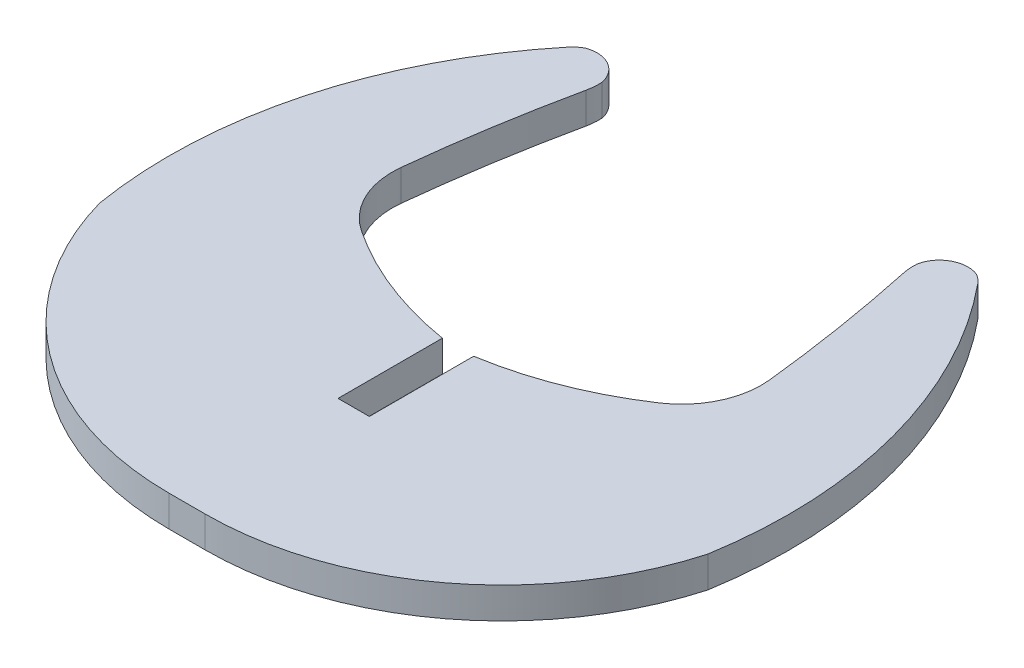
ISO-10303-21;
HEADER;
FILE_DESCRIPTION(('STEP AP214'),'2;1');
FILE_NAME('part.step','',(''),(''),'','','');
FILE_SCHEMA(('AUTOMOTIVE_DESIGN { 1 0 10303 214 1 1 1 1 }'));
ENDSEC;
DATA;
#1=APPLICATION_CONTEXT('core data for automotive mechanical design processes');
#2=APPLICATION_PROTOCOL_DEFINITION('international standard','automotive_design',2000,#1);
#3=PRODUCT_CONTEXT('',#1,'mechanical');
#4=PRODUCT('Part','Part','',(#3));
#5=PRODUCT_RELATED_PRODUCT_CATEGORY('part','',(#4));
#6=PRODUCT_DEFINITION_FORMATION('','',#4);
#7=PRODUCT_DEFINITION_CONTEXT('part definition',#1,'design');
#8=PRODUCT_DEFINITION('design','',#6,#7);
#9=PRODUCT_DEFINITION_SHAPE('','',#8);
#10=(LENGTH_UNIT() NAMED_UNIT(*) SI_UNIT(.MILLI.,.METRE.));
#11=(NAMED_UNIT(*) PLANE_ANGLE_UNIT() SI_UNIT($,.RADIAN.));
#12=(NAMED_UNIT(*) SI_UNIT($,.STERADIAN.) SOLID_ANGLE_UNIT());
#13=UNCERTAINTY_MEASURE_WITH_UNIT(LENGTH_MEASURE(1.E-05),#10,'distance_accuracy_value','');
#14=(GEOMETRIC_REPRESENTATION_CONTEXT(3) GLOBAL_UNCERTAINTY_ASSIGNED_CONTEXT((#13)) GLOBAL_UNIT_ASSIGNED_CONTEXT((#10,
#11,#12)) REPRESENTATION_CONTEXT('',''));
#15=CARTESIAN_POINT('',(0.,0.,0.));
#16=DIRECTION('',(0.,0.,1.));
#17=DIRECTION('',(1.,0.,0.));
#18=AXIS2_PLACEMENT_3D('',#15,#16,#17);
#19=CARTESIAN_POINT('',(197.378953118719,1.45,-339.570008902451));
#20=DIRECTION('',(0.,-1.,0.));
#21=DIRECTION('',(0.,0.,-1.));
#22=AXIS2_PLACEMENT_3D('',#19,#20,#21);
#23=CYLINDRICAL_SURFACE('',#22,21.547899274008);
#24=CARTESIAN_POINT('',(197.378953118719,0.,-339.570008902451));
#25=DIRECTION('',(0.,1.,0.));
#26=DIRECTION('',(0.,0.,1.));
#27=AXIS2_PLACEMENT_3D('',#24,#25,#26);
#28=CIRCLE('',#27,21.547899274008);
#29=CARTESIAN_POINT('',(218.640395151837,0.,-336.068145713355));
#30=VERTEX_POINT('',#29);
#31=CARTESIAN_POINT('',(214.015718080586,0.,-353.264168779069));
#32=VERTEX_POINT('',#31);
#33=EDGE_CURVE('E205',#30,#32,#28,.T.);
#34=ORIENTED_EDGE('',*,*,#33,.T.);
#35=DIRECTION('',(0.,-1.,0.));
#36=VECTOR('',#35,1.);
#37=CARTESIAN_POINT('',(214.015718080586,1.45,-353.264168779069));
#38=LINE('',#37,#36);
#39=CARTESIAN_POINT('',(214.015718080586,1.45,-353.264168779069));
#40=VERTEX_POINT('',#39);
#41=EDGE_CURVE('E11',#40,#32,#38,.T.);
#42=ORIENTED_EDGE('',*,*,#41,.F.);
#43=CARTESIAN_POINT('',(197.378953118719,1.45,-339.570008902451));
#44=DIRECTION('',(0.,1.,0.));
#45=DIRECTION('',(0.,0.,1.));
#46=AXIS2_PLACEMENT_3D('',#43,#44,#45);
#47=CIRCLE('',#46,21.547899274008);
#48=CARTESIAN_POINT('',(218.640395151837,1.45,-336.068145713355));
#49=VERTEX_POINT('',#48);
#50=EDGE_CURVE('E253',#49,#40,#47,.T.);
#51=ORIENTED_EDGE('',*,*,#50,.F.);
#52=DIRECTION('',(0.,-1.,0.));
#53=VECTOR('',#52,1.);
#54=CARTESIAN_POINT('',(218.640395151837,1.45,-336.068145713355));
#55=LINE('',#54,#53);
#56=EDGE_CURVE('E201',#49,#30,#55,.T.);
#57=ORIENTED_EDGE('',*,*,#56,.T.);
#58=EDGE_LOOP('',(#34,#42,#51,#57));
#59=FACE_BOUND('',#58,.T.);
#60=ADVANCED_FACE('F37',(#59),#23,.T.);
#61=CARTESIAN_POINT('',(212.885365432864,1.45,-352.333745075984));
#62=DIRECTION('',(0.,-1.,0.));
#63=DIRECTION('',(0.,0.,-1.));
#64=AXIS2_PLACEMENT_3D('',#61,#62,#63);
#65=CYLINDRICAL_SURFACE('',#64,1.46403052409316);
#66=CARTESIAN_POINT('',(212.885365432864,0.,-352.333745075984));
#67=DIRECTION('',(0.,1.,0.));
#68=DIRECTION('',(0.,0.,1.));
#69=AXIS2_PLACEMENT_3D('',#66,#67,#68);
#70=CIRCLE('',#69,1.46403052409316);
#71=CARTESIAN_POINT('',(213.583617021441,0.,-353.620535693966));
#72=VERTEX_POINT('',#71);
#73=EDGE_CURVE('E208',#32,#72,#70,.T.);
#74=ORIENTED_EDGE('',*,*,#73,.T.);
#75=DIRECTION('',(0.,-1.,0.));
#76=VECTOR('',#75,1.);
#77=CARTESIAN_POINT('',(213.583617021441,1.45,-353.620535693966));
#78=LINE('',#77,#76);
#79=CARTESIAN_POINT('',(213.583617021441,1.45,-353.620535693966));
#80=VERTEX_POINT('',#79);
#81=EDGE_CURVE('E45',#80,#72,#78,.T.);
#82=ORIENTED_EDGE('',*,*,#81,.F.);
#83=CARTESIAN_POINT('',(212.885365432864,1.45,-352.333745075984));
#84=DIRECTION('',(0.,1.,0.));
#85=DIRECTION('',(0.,0.,1.));
#86=AXIS2_PLACEMENT_3D('',#83,#84,#85);
#87=CIRCLE('',#86,1.46403052409316);
#88=EDGE_CURVE('E132',#40,#80,#87,.T.);
#89=ORIENTED_EDGE('',*,*,#88,.F.);
#90=ORIENTED_EDGE('',*,*,#41,.T.);
#91=EDGE_LOOP('',(#74,#82,#89,#90));
#92=FACE_BOUND('',#91,.T.);
#93=ADVANCED_FACE('F365',(#92),#65,.T.);
#94=CARTESIAN_POINT('',(213.114991460386,1.45,-352.377037473618));
#95=DIRECTION('',(0.,-1.,0.));
#96=DIRECTION('',(0.,0.,-1.));
#97=AXIS2_PLACEMENT_3D('',#94,#95,#96);
#98=CYLINDRICAL_SURFACE('',#97,1.32887085169409);
#99=CARTESIAN_POINT('',(213.114991460386,0.,-352.377037473618));
#100=DIRECTION('',(0.,1.,0.));
#101=DIRECTION('',(0.,0.,1.));
#102=AXIS2_PLACEMENT_3D('',#99,#100,#101);
#103=CIRCLE('',#102,1.32887085169409);
#104=CARTESIAN_POINT('',(211.813219702739,0.,-352.644035659891));
#105=VERTEX_POINT('',#104);
#106=EDGE_CURVE('E210',#72,#105,#103,.T.);
#107=ORIENTED_EDGE('',*,*,#106,.T.);
#108=DIRECTION('',(0.,-1.,0.));
#109=VECTOR('',#108,1.);
#110=CARTESIAN_POINT('',(211.813219702739,1.45,-352.644035659891));
#111=LINE('',#110,#109);
#112=CARTESIAN_POINT('',(211.813219702739,1.45,-352.644035659891));
#113=VERTEX_POINT('',#112);
#114=EDGE_CURVE('E286',#113,#105,#111,.T.);
#115=ORIENTED_EDGE('',*,*,#114,.F.);
#116=CARTESIAN_POINT('',(213.114991460386,1.45,-352.377037473618));
#117=DIRECTION('',(0.,1.,0.));
#118=DIRECTION('',(0.,0.,1.));
#119=AXIS2_PLACEMENT_3D('',#116,#117,#118);
#120=CIRCLE('',#119,1.32887085169409);
#121=EDGE_CURVE('E294',#80,#113,#120,.T.);
#122=ORIENTED_EDGE('',*,*,#121,.F.);
#123=ORIENTED_EDGE('',*,*,#81,.T.);
#124=EDGE_LOOP('',(#107,#115,#122,#123));
#125=FACE_BOUND('',#124,.T.);
#126=ADVANCED_FACE('F292',(#125),#98,.T.);
#127=CARTESIAN_POINT('',(214.410192294144,1.45,-352.48032588995));
#128=DIRECTION('',(0.,-1.,0.));
#129=DIRECTION('',(0.,0.,-1.));
#130=AXIS2_PLACEMENT_3D('',#127,#128,#129);
#131=CYLINDRICAL_SURFACE('',#130,2.60212750058202);
#132=CARTESIAN_POINT('',(214.410192294144,0.,-352.48032588995));
#133=DIRECTION('',(0.,1.,0.));
#134=DIRECTION('',(0.,0.,1.));
#135=AXIS2_PLACEMENT_3D('',#132,#133,#134);
#136=CIRCLE('',#135,2.60212750058202);
#137=CARTESIAN_POINT('',(211.865695854604,0.,-351.93571098155));
#138=VERTEX_POINT('',#137);
#139=EDGE_CURVE('E212',#105,#138,#136,.T.);
#140=ORIENTED_EDGE('',*,*,#139,.T.);
#141=DIRECTION('',(0.,-1.,0.));
#142=VECTOR('',#141,1.);
#143=CARTESIAN_POINT('',(211.865695854604,1.45,-351.93571098155));
#144=LINE('',#143,#142);
#145=CARTESIAN_POINT('',(211.865695854604,1.45,-351.93571098155));
#146=VERTEX_POINT('',#145);
#147=EDGE_CURVE('E284',#146,#138,#144,.T.);
#148=ORIENTED_EDGE('',*,*,#147,.F.);
#149=CARTESIAN_POINT('',(214.410192294144,1.45,-352.48032588995));
#150=DIRECTION('',(0.,1.,0.));
#151=DIRECTION('',(0.,0.,1.));
#152=AXIS2_PLACEMENT_3D('',#149,#150,#151);
#153=CIRCLE('',#152,2.60212750058202);
#154=EDGE_CURVE('E305',#113,#146,#153,.T.);
#155=ORIENTED_EDGE('',*,*,#154,.F.);
#156=ORIENTED_EDGE('',*,*,#114,.T.);
#157=EDGE_LOOP('',(#140,#148,#155,#156));
#158=FACE_BOUND('',#157,.T.);
#159=ADVANCED_FACE('F302',(#158),#131,.T.);
#160=CARTESIAN_POINT('',(140.904641555908,1.45,-336.747453381316));
#161=DIRECTION('',(0.,-1.,0.));
#162=DIRECTION('',(0.,0.,-1.));
#163=AXIS2_PLACEMENT_3D('',#160,#161,#162);
#164=CYLINDRICAL_SURFACE('',#163,72.568274032896);
#165=CARTESIAN_POINT('',(140.904641555908,0.,-336.747453381316));
#166=DIRECTION('',(0.,1.,0.));
#167=DIRECTION('',(0.,0.,1.));
#168=AXIS2_PLACEMENT_3D('',#165,#166,#167);
#169=CIRCLE('',#168,72.568274032896);
#170=CARTESIAN_POINT('',(213.055076149438,0.,-344.523646799577));
#171=VERTEX_POINT('',#170);
#172=EDGE_CURVE('E215',#171,#138,#169,.T.);
#173=ORIENTED_EDGE('',*,*,#172,.F.);
#174=DIRECTION('',(0.,-1.,0.));
#175=VECTOR('',#174,1.);
#176=CARTESIAN_POINT('',(213.055076149438,1.45,-344.523646799577));
#177=LINE('',#176,#175);
#178=CARTESIAN_POINT('',(213.055076149438,1.45,-344.523646799577));
#179=VERTEX_POINT('',#178);
#180=EDGE_CURVE('E282',#179,#171,#177,.T.);
#181=ORIENTED_EDGE('',*,*,#180,.F.);
#182=CARTESIAN_POINT('',(140.904641555908,1.45,-336.747453381316));
#183=DIRECTION('',(0.,1.,0.));
#184=DIRECTION('',(0.,0.,1.));
#185=AXIS2_PLACEMENT_3D('',#182,#183,#184);
#186=CIRCLE('',#185,72.568274032896);
#187=EDGE_CURVE('E307',#179,#146,#186,.T.);
#188=ORIENTED_EDGE('',*,*,#187,.T.);
#189=ORIENTED_EDGE('',*,*,#147,.T.);
#190=EDGE_LOOP('',(#173,#181,#188,#189));
#191=FACE_BOUND('',#190,.T.);
#192=ADVANCED_FACE('F376',(#191),#164,.F.);
#193=CARTESIAN_POINT('',(209.3653105977,1.45,-344.125972982407));
#194=DIRECTION('',(0.,-1.,0.));
#195=DIRECTION('',(0.,0.,-1.));
#196=AXIS2_PLACEMENT_3D('',#193,#194,#195);
#197=CYLINDRICAL_SURFACE('',#196,3.71113382831392);
#198=CARTESIAN_POINT('',(209.3653105977,0.,-344.125972982407));
#199=DIRECTION('',(0.,1.,0.));
#200=DIRECTION('',(0.,0.,1.));
#201=AXIS2_PLACEMENT_3D('',#198,#199,#200);
#202=CIRCLE('',#201,3.71113382831392);
#203=CARTESIAN_POINT('',(211.425013911773,0.,-341.038881058014));
#204=VERTEX_POINT('',#203);
#205=EDGE_CURVE('E218',#204,#171,#202,.T.);
#206=ORIENTED_EDGE('',*,*,#205,.F.);
#207=DIRECTION('',(0.,-1.,0.));
#208=VECTOR('',#207,1.);
#209=CARTESIAN_POINT('',(211.425013911773,1.45,-341.038881058014));
#210=LINE('',#209,#208);
#211=CARTESIAN_POINT('',(211.425013911773,1.45,-341.038881058014));
#212=VERTEX_POINT('',#211);
#213=EDGE_CURVE('E280',#212,#204,#210,.T.);
#214=ORIENTED_EDGE('',*,*,#213,.F.);
#215=CARTESIAN_POINT('',(209.3653105977,1.45,-344.125972982407));
#216=DIRECTION('',(0.,1.,0.));
#217=DIRECTION('',(0.,0.,1.));
#218=AXIS2_PLACEMENT_3D('',#215,#216,#217);
#219=CIRCLE('',#218,3.71113382831392);
#220=EDGE_CURVE('E309',#212,#179,#219,.T.);
#221=ORIENTED_EDGE('',*,*,#220,.T.);
#222=ORIENTED_EDGE('',*,*,#180,.T.);
#223=EDGE_LOOP('',(#206,#214,#221,#222));
#224=FACE_BOUND('',#223,.T.);
#225=ADVANCED_FACE('F379',(#224),#197,.F.);
#226=CARTESIAN_POINT('',(202.672696827723,1.45,-354.156888171361));
#227=DIRECTION('',(0.,-1.,0.));
#228=DIRECTION('',(0.,0.,-1.));
#229=AXIS2_PLACEMENT_3D('',#226,#227,#228);
#230=CYLINDRICAL_SURFACE('',#229,15.769754752867);
#231=CARTESIAN_POINT('',(202.672696827723,0.,-354.156888171361));
#232=DIRECTION('',(0.,1.,0.));
#233=DIRECTION('',(0.,0.,1.));
#234=AXIS2_PLACEMENT_3D('',#231,#232,#233);
#235=CIRCLE('',#234,15.769754752867);
#236=CARTESIAN_POINT('',(205.206272308741,0.,-338.591986621799));
#237=VERTEX_POINT('',#236);
#238=EDGE_CURVE('E221',#237,#204,#235,.T.);
#239=ORIENTED_EDGE('',*,*,#238,.F.);
#240=DIRECTION('',(0.,-1.,0.));
#241=VECTOR('',#240,1.);
#242=CARTESIAN_POINT('',(205.206272308741,1.45,-338.591986621799));
#243=LINE('',#242,#241);
#244=CARTESIAN_POINT('',(205.206272308741,1.45,-338.591986621799));
#245=VERTEX_POINT('',#244);
#246=EDGE_CURVE('E278',#245,#237,#243,.T.);
#247=ORIENTED_EDGE('',*,*,#246,.F.);
#248=CARTESIAN_POINT('',(202.672696827723,1.45,-354.156888171361));
#249=DIRECTION('',(0.,1.,0.));
#250=DIRECTION('',(0.,0.,1.));
#251=AXIS2_PLACEMENT_3D('',#248,#249,#250);
#252=CIRCLE('',#251,15.769754752867);
#253=EDGE_CURVE('E316',#245,#212,#252,.T.);
#254=ORIENTED_EDGE('',*,*,#253,.T.);
#255=ORIENTED_EDGE('',*,*,#213,.T.);
#256=EDGE_LOOP('',(#239,#247,#254,#255));
#257=FACE_BOUND('',#256,.T.);
#258=ADVANCED_FACE('F383',(#257),#230,.F.);
#259=CARTESIAN_POINT('',(205.206272308729,1.45,-266.90667072089));
#260=DIRECTION('',(-1.,0.,-1.71330523696953E-13));
#261=DIRECTION('',(-1.71330523696953E-13,0.,1.));
#262=AXIS2_PLACEMENT_3D('',#259,#260,#261);
#263=PLANE('',#262);
#264=DIRECTION('',(1.71330523696953E-13,0.,-1.));
#265=VECTOR('',#264,1.);
#266=CARTESIAN_POINT('',(205.206272308729,0.,-266.90667072089));
#267=LINE('',#266,#265);
#268=CARTESIAN_POINT('',(205.20627230874,0.,-333.73198123279));
#269=VERTEX_POINT('',#268);
#270=EDGE_CURVE('E224',#269,#237,#267,.T.);
#271=ORIENTED_EDGE('',*,*,#270,.F.);
#272=DIRECTION('',(0.,-1.,0.));
#273=VECTOR('',#272,1.);
#274=CARTESIAN_POINT('',(205.20627230874,1.45,-333.73198123279));
#275=LINE('',#274,#273);
#276=CARTESIAN_POINT('',(205.20627230874,1.45,-333.73198123279));
#277=VERTEX_POINT('',#276);
#278=EDGE_CURVE('E276',#277,#269,#275,.T.);
#279=ORIENTED_EDGE('',*,*,#278,.F.);
#280=DIRECTION('',(1.71330523696953E-13,0.,-1.));
#281=VECTOR('',#280,1.);
#282=CARTESIAN_POINT('',(205.206272308729,1.45,-266.90667072089));
#283=LINE('',#282,#281);
#284=EDGE_CURVE('E319',#277,#245,#283,.T.);
#285=ORIENTED_EDGE('',*,*,#284,.T.);
#286=ORIENTED_EDGE('',*,*,#246,.T.);
#287=EDGE_LOOP('',(#271,#279,#285,#286));
#288=FACE_BOUND('',#287,.T.);
#289=ADVANCED_FACE('F387',(#288),#263,.T.);
#290=CARTESIAN_POINT('',(-48.360559474051,1.45,-333.73198123279));
#291=DIRECTION('',(0.,0.,-1.));
#292=DIRECTION('',(-1.,0.,0.));
#293=AXIS2_PLACEMENT_3D('',#290,#291,#292);
#294=PLANE('',#293);
#295=DIRECTION('',(1.,0.,0.));
#296=VECTOR('',#295,1.);
#297=CARTESIAN_POINT('',(-48.360559474051,0.,-333.73198123279));
#298=LINE('',#297,#296);
#299=CARTESIAN_POINT('',(203.74827050989,0.,-333.73198123279));
#300=VERTEX_POINT('',#299);
#301=EDGE_CURVE('E227',#300,#269,#298,.T.);
#302=ORIENTED_EDGE('',*,*,#301,.F.);
#303=DIRECTION('',(0.,-1.,0.));
#304=VECTOR('',#303,1.);
#305=CARTESIAN_POINT('',(203.74827050989,1.45,-333.73198123279));
#306=LINE('',#305,#304);
#307=CARTESIAN_POINT('',(203.74827050989,1.45,-333.73198123279));
#308=VERTEX_POINT('',#307);
#309=EDGE_CURVE('E274',#308,#300,#306,.T.);
#310=ORIENTED_EDGE('',*,*,#309,.F.);
#311=DIRECTION('',(1.,0.,0.));
#312=VECTOR('',#311,1.);
#313=CARTESIAN_POINT('',(-48.360559474051,1.45,-333.73198123279));
#314=LINE('',#313,#312);
#315=EDGE_CURVE('E322',#308,#277,#314,.T.);
#316=ORIENTED_EDGE('',*,*,#315,.T.);
#317=ORIENTED_EDGE('',*,*,#278,.T.);
#318=EDGE_LOOP('',(#302,#310,#316,#317));
#319=FACE_BOUND('',#318,.T.);
#320=ADVANCED_FACE('F391',(#319),#294,.T.);
#321=CARTESIAN_POINT('',(203.748281316028,1.45,-266.90671148879));
#322=DIRECTION('',(-0.999999999999987,0.,1.61707366351748E-07));
#323=DIRECTION('',(1.61707366351748E-07,0.,0.999999999999987));
#324=AXIS2_PLACEMENT_3D('',#321,#322,#323);
#325=PLANE('',#324);
#326=DIRECTION('',(-1.61707366351748E-07,0.,-0.999999999999987));
#327=VECTOR('',#326,1.);
#328=CARTESIAN_POINT('',(203.748281316028,0.,-266.90671148879));
#329=LINE('',#328,#327);
#330=CARTESIAN_POINT('',(203.748269723991,0.,-338.591986840162));
#331=VERTEX_POINT('',#330);
#332=EDGE_CURVE('E230',#300,#331,#329,.T.);
#333=ORIENTED_EDGE('',*,*,#332,.T.);
#334=DIRECTION('',(0.,-1.,0.));
#335=VECTOR('',#334,1.);
#336=CARTESIAN_POINT('',(203.748269723991,1.45,-338.591986840162));
#337=LINE('',#336,#335);
#338=CARTESIAN_POINT('',(203.748269723991,1.45,-338.591986840162));
#339=VERTEX_POINT('',#338);
#340=EDGE_CURVE('E272',#339,#331,#337,.T.);
#341=ORIENTED_EDGE('',*,*,#340,.F.);
#342=DIRECTION('',(-1.61707366351748E-07,0.,-0.999999999999987));
#343=VECTOR('',#342,1.);
#344=CARTESIAN_POINT('',(203.748281316028,1.45,-266.90671148879));
#345=LINE('',#344,#343);
#346=EDGE_CURVE('E325',#308,#339,#345,.T.);
#347=ORIENTED_EDGE('',*,*,#346,.F.);
#348=ORIENTED_EDGE('',*,*,#309,.T.);
#349=EDGE_LOOP('',(#333,#341,#347,#348));
#350=FACE_BOUND('',#349,.T.);
#351=ADVANCED_FACE('F395',(#350),#325,.F.);
#352=CARTESIAN_POINT('',(206.281846596879,1.45,-354.156888163163));
#353=DIRECTION('',(0.,-1.,0.));
#354=DIRECTION('',(0.,0.,-1.));
#355=AXIS2_PLACEMENT_3D('',#352,#353,#354);
#356=CYLINDRICAL_SURFACE('',#355,15.769754752867);
#357=CARTESIAN_POINT('',(206.281846596879,0.,-354.156888163163));
#358=DIRECTION('',(0.,1.,0.));
#359=DIRECTION('',(0.,0.,1.));
#360=AXIS2_PLACEMENT_3D('',#357,#358,#359);
#361=CIRCLE('',#360,15.769754752867);
#362=CARTESIAN_POINT('',(197.529529117413,0.,-341.038881313636));
#363=VERTEX_POINT('',#362);
#364=EDGE_CURVE('E233',#363,#331,#361,.T.);
#365=ORIENTED_EDGE('',*,*,#364,.F.);
#366=DIRECTION('',(0.,-1.,0.));
#367=VECTOR('',#366,1.);
#368=CARTESIAN_POINT('',(197.529529117413,1.45,-341.038881313636));
#369=LINE('',#368,#367);
#370=CARTESIAN_POINT('',(197.529529117413,1.45,-341.038881313636));
#371=VERTEX_POINT('',#370);
#372=EDGE_CURVE('E270',#371,#363,#369,.T.);
#373=ORIENTED_EDGE('',*,*,#372,.F.);
#374=CARTESIAN_POINT('',(206.281846596879,1.45,-354.156888163163));
#375=DIRECTION('',(0.,1.,0.));
#376=DIRECTION('',(0.,0.,1.));
#377=AXIS2_PLACEMENT_3D('',#374,#375,#376);
#378=CIRCLE('',#377,15.769754752867);
#379=EDGE_CURVE('E327',#371,#339,#378,.T.);
#380=ORIENTED_EDGE('',*,*,#379,.T.);
#381=ORIENTED_EDGE('',*,*,#340,.T.);
#382=EDGE_LOOP('',(#365,#373,#380,#381));
#383=FACE_BOUND('',#382,.T.);
#384=ADVANCED_FACE('F399',(#383),#356,.F.);
#385=CARTESIAN_POINT('',(199.589232463917,1.45,-344.125973216391));
#386=DIRECTION('',(0.,-1.,0.));
#387=DIRECTION('',(0.,0.,-1.));
#388=AXIS2_PLACEMENT_3D('',#385,#386,#387);
#389=CYLINDRICAL_SURFACE('',#388,3.71113382831382);
#390=CARTESIAN_POINT('',(199.589232463917,0.,-344.125973216391));
#391=DIRECTION('',(0.,1.,0.));
#392=DIRECTION('',(0.,0.,1.));
#393=AXIS2_PLACEMENT_3D('',#390,#391,#392);
#394=CIRCLE('',#393,3.71113382831382);
#395=CARTESIAN_POINT('',(195.899466211039,0.,-344.523640528065));
#396=VERTEX_POINT('',#395);
#397=EDGE_CURVE('E236',#396,#363,#394,.T.);
#398=ORIENTED_EDGE('',*,*,#397,.F.);
#399=DIRECTION('',(0.,-1.,0.));
#400=VECTOR('',#399,1.);
#401=CARTESIAN_POINT('',(195.899466211039,1.45,-344.523640528065));
#402=LINE('',#401,#400);
#403=CARTESIAN_POINT('',(195.899466211039,1.45,-344.523640528065));
#404=VERTEX_POINT('',#403);
#405=EDGE_CURVE('E268',#404,#396,#402,.T.);
#406=ORIENTED_EDGE('',*,*,#405,.F.);
#407=CARTESIAN_POINT('',(199.589232463917,1.45,-344.125973216391));
#408=DIRECTION('',(0.,1.,0.));
#409=DIRECTION('',(0.,0.,1.));
#410=AXIS2_PLACEMENT_3D('',#407,#408,#409);
#411=CIRCLE('',#410,3.71113382831382);
#412=EDGE_CURVE('E330',#404,#371,#411,.T.);
#413=ORIENTED_EDGE('',*,*,#412,.T.);
#414=ORIENTED_EDGE('',*,*,#372,.T.);
#415=EDGE_LOOP('',(#398,#406,#413,#414));
#416=FACE_BOUND('',#415,.T.);
#417=ADVANCED_FACE('F403',(#416),#389,.F.);
#418=CARTESIAN_POINT('',(268.0499014531,1.45,-336.74745312712));
#419=DIRECTION('',(0.,-1.,0.));
#420=DIRECTION('',(0.,0.,-1.));
#421=AXIS2_PLACEMENT_3D('',#418,#419,#420);
#422=CYLINDRICAL_SURFACE('',#421,72.568274032896);
#423=CARTESIAN_POINT('',(268.0499014531,0.,-336.74745312712));
#424=DIRECTION('',(0.,1.,0.));
#425=DIRECTION('',(0.,0.,1.));
#426=AXIS2_PLACEMENT_3D('',#423,#424,#425);
#427=CIRCLE('',#426,72.568274032896);
#428=CARTESIAN_POINT('',(197.088845881612,0.,-351.935704780741));
#429=VERTEX_POINT('',#428);
#430=EDGE_CURVE('E239',#429,#396,#427,.T.);
#431=ORIENTED_EDGE('',*,*,#430,.F.);
#432=DIRECTION('',(0.,-1.,0.));
#433=VECTOR('',#432,1.);
#434=CARTESIAN_POINT('',(197.088845881612,1.45,-351.935704780741));
#435=LINE('',#434,#433);
#436=CARTESIAN_POINT('',(197.088845881612,1.45,-351.935704780741));
#437=VERTEX_POINT('',#436);
#438=EDGE_CURVE('E266',#437,#429,#435,.T.);
#439=ORIENTED_EDGE('',*,*,#438,.F.);
#440=CARTESIAN_POINT('',(268.0499014531,1.45,-336.74745312712));
#441=DIRECTION('',(0.,1.,0.));
#442=DIRECTION('',(0.,0.,1.));
#443=AXIS2_PLACEMENT_3D('',#440,#441,#442);
#444=CIRCLE('',#443,72.568274032896);
#445=EDGE_CURVE('E333',#437,#404,#444,.T.);
#446=ORIENTED_EDGE('',*,*,#445,.T.);
#447=ORIENTED_EDGE('',*,*,#405,.T.);
#448=EDGE_LOOP('',(#431,#439,#446,#447));
#449=FACE_BOUND('',#448,.T.);
#450=ADVANCED_FACE('F407',(#449),#422,.F.);
#451=CARTESIAN_POINT('',(194.544350818955,1.45,-352.480325851864));
#452=DIRECTION('',(0.,-1.,0.));
#453=DIRECTION('',(0.,0.,-1.));
#454=AXIS2_PLACEMENT_3D('',#451,#452,#453);
#455=CYLINDRICAL_SURFACE('',#454,2.60212744403451);
#456=CARTESIAN_POINT('',(194.544350818955,0.,-352.480325851864));
#457=DIRECTION('',(0.,1.,0.));
#458=DIRECTION('',(0.,0.,1.));
#459=AXIS2_PLACEMENT_3D('',#456,#457,#458);
#460=CIRCLE('',#459,2.60212744403451);
#461=CARTESIAN_POINT('',(197.141323348593,0.,-352.644035702827));
#462=VERTEX_POINT('',#461);
#463=EDGE_CURVE('E242',#429,#462,#460,.T.);
#464=ORIENTED_EDGE('',*,*,#463,.T.);
#465=DIRECTION('',(0.,-1.,0.));
#466=VECTOR('',#465,1.);
#467=CARTESIAN_POINT('',(197.141323348593,1.45,-352.644035702827));
#468=LINE('',#467,#466);
#469=CARTESIAN_POINT('',(197.141323348593,1.45,-352.644035702827));
#470=VERTEX_POINT('',#469);
#471=EDGE_CURVE('E263',#470,#462,#468,.T.);
#472=ORIENTED_EDGE('',*,*,#471,.F.);
#473=CARTESIAN_POINT('',(194.544350818955,1.45,-352.480325851864));
#474=DIRECTION('',(0.,1.,0.));
#475=DIRECTION('',(0.,0.,1.));
#476=AXIS2_PLACEMENT_3D('',#473,#474,#475);
#477=CIRCLE('',#476,2.60212744403451);
#478=EDGE_CURVE('E336',#437,#470,#477,.T.);
#479=ORIENTED_EDGE('',*,*,#478,.F.);
#480=ORIENTED_EDGE('',*,*,#438,.T.);
#481=EDGE_LOOP('',(#464,#472,#479,#480));
#482=FACE_BOUND('',#481,.T.);
#483=ADVANCED_FACE('F411',(#482),#455,.T.);
#484=CARTESIAN_POINT('',(195.8395516277,1.45,-352.377037337354));
#485=DIRECTION('',(0.,-1.,0.));
#486=DIRECTION('',(0.,0.,-1.));
#487=AXIS2_PLACEMENT_3D('',#484,#485,#486);
#488=CYLINDRICAL_SURFACE('',#487,1.32887085169409);
#489=CARTESIAN_POINT('',(195.8395516277,0.,-352.377037337354));
#490=DIRECTION('',(0.,1.,0.));
#491=DIRECTION('',(0.,0.,1.));
#492=AXIS2_PLACEMENT_3D('',#489,#490,#491);
#493=CIRCLE('',#492,1.32887085169409);
#494=CARTESIAN_POINT('',(195.370925998086,0.,-353.620535531865));
#495=VERTEX_POINT('',#494);
#496=EDGE_CURVE('E244',#462,#495,#493,.T.);
#497=ORIENTED_EDGE('',*,*,#496,.T.);
#498=DIRECTION('',(0.,-1.,0.));
#499=VECTOR('',#498,1.);
#500=CARTESIAN_POINT('',(195.370925998086,1.45,-353.620535531865));
#501=LINE('',#500,#499);
#502=CARTESIAN_POINT('',(195.370925998086,1.45,-353.620535531865));
#503=VERTEX_POINT('',#502);
#504=EDGE_CURVE('E260',#503,#495,#501,.T.);
#505=ORIENTED_EDGE('',*,*,#504,.F.);
#506=CARTESIAN_POINT('',(195.8395516277,1.45,-352.377037337354));
#507=DIRECTION('',(0.,1.,0.));
#508=DIRECTION('',(0.,0.,1.));
#509=AXIS2_PLACEMENT_3D('',#506,#507,#508);
#510=CIRCLE('',#509,1.32887085169409);
#511=EDGE_CURVE('E338',#470,#503,#510,.T.);
#512=ORIENTED_EDGE('',*,*,#511,.F.);
#513=ORIENTED_EDGE('',*,*,#471,.T.);
#514=EDGE_LOOP('',(#497,#505,#512,#513));
#515=FACE_BOUND('',#514,.T.);
#516=ADVANCED_FACE('F415',(#515),#488,.T.);
#517=CARTESIAN_POINT('',(196.069177259765,1.45,-352.333744736498));
#518=DIRECTION('',(0.,-1.,0.));
#519=DIRECTION('',(0.,0.,-1.));
#520=AXIS2_PLACEMENT_3D('',#517,#518,#519);
#521=CYLINDRICAL_SURFACE('',#520,1.46403052409321);
#522=CARTESIAN_POINT('',(196.069177259765,0.,-352.333744736498));
#523=DIRECTION('',(0.,1.,0.));
#524=DIRECTION('',(0.,0.,1.));
#525=AXIS2_PLACEMENT_3D('',#522,#523,#524);
#526=CIRCLE('',#525,1.46403052409321);
#527=CARTESIAN_POINT('',(194.938824586605,0.,-353.26416840868));
#528=VERTEX_POINT('',#527);
#529=EDGE_CURVE('E246',#495,#528,#526,.T.);
#530=ORIENTED_EDGE('',*,*,#529,.T.);
#531=DIRECTION('',(0.,-1.,0.));
#532=VECTOR('',#531,1.);
#533=CARTESIAN_POINT('',(194.938824586605,1.45,-353.26416840868));
#534=LINE('',#533,#532);
#535=CARTESIAN_POINT('',(194.938824586605,1.45,-353.26416840868));
#536=VERTEX_POINT('',#535);
#537=EDGE_CURVE('E257',#536,#528,#534,.T.);
#538=ORIENTED_EDGE('',*,*,#537,.F.);
#539=CARTESIAN_POINT('',(196.069177259765,1.45,-352.333744736498));
#540=DIRECTION('',(0.,1.,0.));
#541=DIRECTION('',(0.,0.,1.));
#542=AXIS2_PLACEMENT_3D('',#539,#540,#541);
#543=CIRCLE('',#542,1.46403052409321);
#544=EDGE_CURVE('E340',#503,#536,#543,.T.);
#545=ORIENTED_EDGE('',*,*,#544,.F.);
#546=ORIENTED_EDGE('',*,*,#504,.T.);
#547=EDGE_LOOP('',(#530,#538,#545,#546));
#548=FACE_BOUND('',#547,.T.);
#549=ADVANCED_FACE('F346',(#548),#521,.T.);
#550=CARTESIAN_POINT('',(211.575589749915,1.45,-339.570008776788));
#551=DIRECTION('',(0.,-1.,0.));
#552=DIRECTION('',(0.,0.,-1.));
#553=AXIS2_PLACEMENT_3D('',#550,#551,#552);
#554=CYLINDRICAL_SURFACE('',#553,21.547899274009);
#555=CARTESIAN_POINT('',(211.575589749915,0.,-339.570008776788));
#556=DIRECTION('',(0.,1.,0.));
#557=DIRECTION('',(0.,0.,1.));
#558=AXIS2_PLACEMENT_3D('',#555,#556,#557);
#559=CIRCLE('',#558,21.547899274009);
#560=CARTESIAN_POINT('',(190.3141480093,0.,-336.068143811758));
#561=VERTEX_POINT('',#560);
#562=EDGE_CURVE('E248',#528,#561,#559,.T.);
#563=ORIENTED_EDGE('',*,*,#562,.T.);
#564=DIRECTION('',(0.,-1.,0.));
#565=VECTOR('',#564,1.);
#566=CARTESIAN_POINT('',(190.3141480093,1.45,-336.068143811758));
#567=LINE('',#566,#565);
#568=CARTESIAN_POINT('',(190.3141480093,1.45,-336.068143811758));
#569=VERTEX_POINT('',#568);
#570=EDGE_CURVE('E196',#569,#561,#567,.T.);
#571=ORIENTED_EDGE('',*,*,#570,.F.);
#572=CARTESIAN_POINT('',(211.575589749915,1.45,-339.570008776788));
#573=DIRECTION('',(0.,1.,0.));
#574=DIRECTION('',(0.,0.,1.));
#575=AXIS2_PLACEMENT_3D('',#572,#573,#574);
#576=CIRCLE('',#575,21.547899274009);
#577=EDGE_CURVE('E187',#536,#569,#576,.T.);
#578=ORIENTED_EDGE('',*,*,#577,.F.);
#579=ORIENTED_EDGE('',*,*,#537,.T.);
#580=EDGE_LOOP('',(#563,#571,#578,#579));
#581=FACE_BOUND('',#580,.T.);
#582=ADVANCED_FACE('F350',(#581),#554,.T.);
#583=CARTESIAN_POINT('',(203.63360199937,1.45,-339.80894830271));
#584=DIRECTION('',(0.,-1.,0.));
#585=DIRECTION('',(0.,0.,-1.));
#586=AXIS2_PLACEMENT_3D('',#583,#584,#585);
#587=CYLINDRICAL_SURFACE('',#586,13.834792113838);
#588=CARTESIAN_POINT('',(203.63360199937,0.,-339.80894830271));
#589=DIRECTION('',(0.,1.,0.));
#590=DIRECTION('',(0.,0.,1.));
#591=AXIS2_PLACEMENT_3D('',#588,#589,#590);
#592=CIRCLE('',#591,13.834792113838);
#593=CARTESIAN_POINT('',(203.63360232221,0.,-325.974156188872));
#594=VERTEX_POINT('',#593);
#595=EDGE_CURVE('E195',#561,#594,#592,.T.);
#596=ORIENTED_EDGE('',*,*,#595,.T.);
#597=DIRECTION('',(0.,-1.,0.));
#598=VECTOR('',#597,1.);
#599=CARTESIAN_POINT('',(203.63360232221,1.45,-325.974156188872));
#600=LINE('',#599,#598);
#601=CARTESIAN_POINT('',(203.63360232221,1.45,-325.974156188872));
#602=VERTEX_POINT('',#601);
#603=EDGE_CURVE('E192',#602,#594,#600,.T.);
#604=ORIENTED_EDGE('',*,*,#603,.F.);
#605=CARTESIAN_POINT('',(203.63360199937,1.45,-339.80894830271));
#606=DIRECTION('',(0.,1.,0.));
#607=DIRECTION('',(0.,0.,1.));
#608=AXIS2_PLACEMENT_3D('',#605,#606,#607);
#609=CIRCLE('',#608,13.834792113838);
#610=EDGE_CURVE('E181',#569,#602,#609,.T.);
#611=ORIENTED_EDGE('',*,*,#610,.F.);
#612=ORIENTED_EDGE('',*,*,#570,.T.);
#613=EDGE_LOOP('',(#596,#604,#611,#612));
#614=FACE_BOUND('',#613,.T.);
#615=ADVANCED_FACE('F193',(#614),#587,.T.);
#616=CARTESIAN_POINT('',(-48.3605594739791,1.45,-325.974156189179));
#617=DIRECTION('',(1.21725002560174E-12,0.,-1.));
#618=DIRECTION('',(-1.,0.,-1.21725002560174E-12));
#619=AXIS2_PLACEMENT_3D('',#616,#617,#618);
#620=PLANE('',#619);
#621=DIRECTION('',(1.,0.,1.21725002560174E-12));
#622=VECTOR('',#621,1.);
#623=CARTESIAN_POINT('',(-48.3605594739791,0.,-325.974156189179));
#624=LINE('',#623,#622);
#625=CARTESIAN_POINT('',(205.3209406277,0.,-325.97415618887));
#626=VERTEX_POINT('',#625);
#627=EDGE_CURVE('E118',#594,#626,#624,.T.);
#628=ORIENTED_EDGE('',*,*,#627,.T.);
#629=DIRECTION('',(0.,-1.,0.));
#630=VECTOR('',#629,1.);
#631=CARTESIAN_POINT('',(205.3209406277,1.45,-325.97415618887));
#632=LINE('',#631,#630);
#633=CARTESIAN_POINT('',(205.3209406277,1.45,-325.97415618887));
#634=VERTEX_POINT('',#633);
#635=EDGE_CURVE('E197',#634,#626,#632,.T.);
#636=ORIENTED_EDGE('',*,*,#635,.F.);
#637=DIRECTION('',(1.,0.,1.21725002560174E-12));
#638=VECTOR('',#637,1.);
#639=CARTESIAN_POINT('',(-48.3605594739791,1.45,-325.974156189179));
#640=LINE('',#639,#638);
#641=EDGE_CURVE('E185',#602,#634,#640,.T.);
#642=ORIENTED_EDGE('',*,*,#641,.F.);
#643=ORIENTED_EDGE('',*,*,#603,.T.);
#644=EDGE_LOOP('',(#628,#636,#642,#643));
#645=FACE_BOUND('',#644,.T.);
#646=ADVANCED_FACE('F199',(#645),#620,.F.);
#647=CARTESIAN_POINT('',(205.320940627699,1.45,-339.808948302708));
#648=DIRECTION('',(0.,-1.,0.));
#649=DIRECTION('',(0.,0.,-1.));
#650=AXIS2_PLACEMENT_3D('',#647,#648,#649);
#651=CYLINDRICAL_SURFACE('',#650,13.8347921138376);
#652=CARTESIAN_POINT('',(205.320940627699,0.,-339.808948302708));
#653=DIRECTION('',(0.,1.,0.));
#654=DIRECTION('',(0.,0.,1.));
#655=AXIS2_PLACEMENT_3D('',#652,#653,#654);
#656=CIRCLE('',#655,13.8347921138376);
#657=EDGE_CURVE('E124',#626,#30,#656,.T.);
#658=ORIENTED_EDGE('',*,*,#657,.T.);
#659=ORIENTED_EDGE('',*,*,#56,.F.);
#660=CARTESIAN_POINT('',(205.320940627699,1.45,-339.808948302708));
#661=DIRECTION('',(0.,1.,0.));
#662=DIRECTION('',(0.,0.,1.));
#663=AXIS2_PLACEMENT_3D('',#660,#661,#662);
#664=CIRCLE('',#663,13.8347921138376);
#665=EDGE_CURVE('E53',#634,#49,#664,.T.);
#666=ORIENTED_EDGE('',*,*,#665,.F.);
#667=ORIENTED_EDGE('',*,*,#635,.T.);
#668=EDGE_LOOP('',(#658,#659,#666,#667));
#669=FACE_BOUND('',#668,.T.);
#670=ADVANCED_FACE('F354',(#669),#651,.T.);
#671=CARTESIAN_POINT('',(-48.360559474051,1.45,-266.906670720934));
#672=DIRECTION('',(0.,1.,0.));
#673=DIRECTION('',(0.,0.,1.));
#674=AXIS2_PLACEMENT_3D('',#671,#672,#673);
#675=PLANE('',#674);
#676=ORIENTED_EDGE('',*,*,#50,.T.);
#677=ORIENTED_EDGE('',*,*,#88,.T.);
#678=ORIENTED_EDGE('',*,*,#121,.T.);
#679=ORIENTED_EDGE('',*,*,#154,.T.);
#680=ORIENTED_EDGE('',*,*,#187,.F.);
#681=ORIENTED_EDGE('',*,*,#220,.F.);
#682=ORIENTED_EDGE('',*,*,#253,.F.);
#683=ORIENTED_EDGE('',*,*,#284,.F.);
#684=ORIENTED_EDGE('',*,*,#315,.F.);
#685=ORIENTED_EDGE('',*,*,#346,.T.);
#686=ORIENTED_EDGE('',*,*,#379,.F.);
#687=ORIENTED_EDGE('',*,*,#412,.F.);
#688=ORIENTED_EDGE('',*,*,#445,.F.);
#689=ORIENTED_EDGE('',*,*,#478,.T.);
#690=ORIENTED_EDGE('',*,*,#511,.T.);
#691=ORIENTED_EDGE('',*,*,#544,.T.);
#692=ORIENTED_EDGE('',*,*,#577,.T.);
#693=ORIENTED_EDGE('',*,*,#610,.T.);
#694=ORIENTED_EDGE('',*,*,#641,.T.);
#695=ORIENTED_EDGE('',*,*,#665,.T.);
#696=EDGE_LOOP('',(#676,#677,#678,#679,#680,#681,#682,#683,#684,#685,#686,#687,#688,#689,#690,
#691,#692,#693,#694,#695));
#697=FACE_BOUND('',#696,.T.);
#698=ADVANCED_FACE('F183',(#697),#675,.T.);
#699=CARTESIAN_POINT('',(-48.360559474051,0.,-266.906670720934));
#700=DIRECTION('',(0.,1.,0.));
#701=DIRECTION('',(0.,0.,1.));
#702=AXIS2_PLACEMENT_3D('',#699,#700,#701);
#703=PLANE('',#702);
#704=ORIENTED_EDGE('',*,*,#33,.F.);
#705=ORIENTED_EDGE('',*,*,#657,.F.);
#706=ORIENTED_EDGE('',*,*,#627,.F.);
#707=ORIENTED_EDGE('',*,*,#595,.F.);
#708=ORIENTED_EDGE('',*,*,#562,.F.);
#709=ORIENTED_EDGE('',*,*,#529,.F.);
#710=ORIENTED_EDGE('',*,*,#496,.F.);
#711=ORIENTED_EDGE('',*,*,#463,.F.);
#712=ORIENTED_EDGE('',*,*,#430,.T.);
#713=ORIENTED_EDGE('',*,*,#397,.T.);
#714=ORIENTED_EDGE('',*,*,#364,.T.);
#715=ORIENTED_EDGE('',*,*,#332,.F.);
#716=ORIENTED_EDGE('',*,*,#301,.T.);
#717=ORIENTED_EDGE('',*,*,#270,.T.);
#718=ORIENTED_EDGE('',*,*,#238,.T.);
#719=ORIENTED_EDGE('',*,*,#205,.T.);
#720=ORIENTED_EDGE('',*,*,#172,.T.);
#721=ORIENTED_EDGE('',*,*,#139,.F.);
#722=ORIENTED_EDGE('',*,*,#106,.F.);
#723=ORIENTED_EDGE('',*,*,#73,.F.);
#724=EDGE_LOOP('',(#704,#705,#706,#707,#708,#709,#710,#711,#712,#713,#714,#715,#716,#717,#718,
#719,#720,#721,#722,#723));
#725=FACE_BOUND('',#724,.T.);
#726=ADVANCED_FACE('F298',(#725),#703,.F.);
#727=CLOSED_SHELL('',(#60,#93,#126,#159,#192,#225,#258,#289,#320,#351,#384,#417,#450,#483,#516,
#549,#582,#615,#646,#670,#698,#726));
#728=MANIFOLD_SOLID_BREP('B2',#727);
#729=ADVANCED_BREP_SHAPE_REPRESENTATION('',(#18,#728),#14);
#730=SHAPE_DEFINITION_REPRESENTATION(#9,#729);
ENDSEC;
END-ISO-10303-21;
